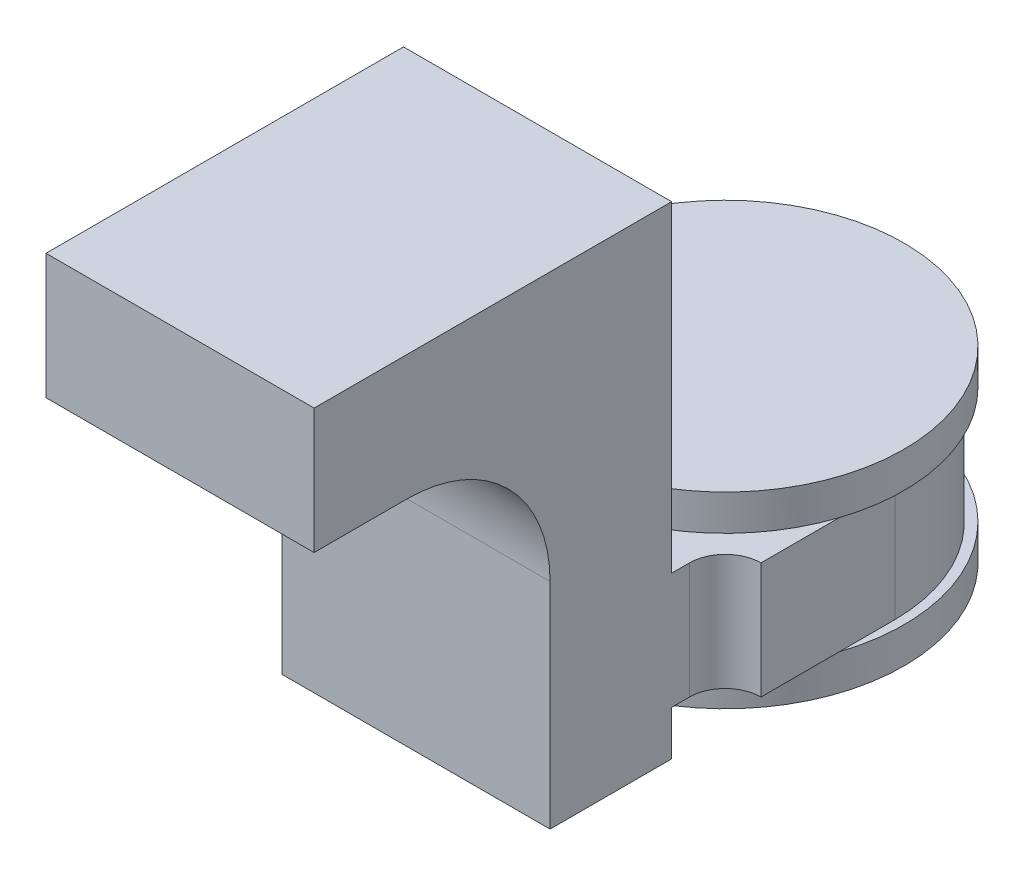
ISO-10303-21;
HEADER;
FILE_DESCRIPTION(('STEP AP214'),'2;1');
FILE_NAME('part.step','',(''),(''),'','','');
FILE_SCHEMA(('AUTOMOTIVE_DESIGN { 1 0 10303 214 1 1 1 1 }'));
ENDSEC;
DATA;
#1=APPLICATION_CONTEXT('core data for automotive mechanical design processes');
#2=APPLICATION_PROTOCOL_DEFINITION('international standard','automotive_design',2000,#1);
#3=PRODUCT_CONTEXT('',#1,'mechanical');
#4=PRODUCT('Part','Part','',(#3));
#5=PRODUCT_RELATED_PRODUCT_CATEGORY('part','',(#4));
#6=PRODUCT_DEFINITION_FORMATION('','',#4);
#7=PRODUCT_DEFINITION_CONTEXT('part definition',#1,'design');
#8=PRODUCT_DEFINITION('design','',#6,#7);
#9=PRODUCT_DEFINITION_SHAPE('','',#8);
#10=(LENGTH_UNIT() NAMED_UNIT(*) SI_UNIT(.MILLI.,.METRE.));
#11=(NAMED_UNIT(*) PLANE_ANGLE_UNIT() SI_UNIT($,.RADIAN.));
#12=(NAMED_UNIT(*) SI_UNIT($,.STERADIAN.) SOLID_ANGLE_UNIT());
#13=UNCERTAINTY_MEASURE_WITH_UNIT(LENGTH_MEASURE(1.E-05),#10,'distance_accuracy_value','');
#14=(GEOMETRIC_REPRESENTATION_CONTEXT(3) GLOBAL_UNCERTAINTY_ASSIGNED_CONTEXT((#13)) GLOBAL_UNIT_ASSIGNED_CONTEXT((#10,
#11,#12)) REPRESENTATION_CONTEXT('',''));
#15=CARTESIAN_POINT('',(0.,0.,0.));
#16=DIRECTION('',(0.,0.,1.));
#17=DIRECTION('',(1.,0.,0.));
#18=AXIS2_PLACEMENT_3D('',#15,#16,#17);
#19=CARTESIAN_POINT('',(7.5,0.,0.));
#20=DIRECTION('',(-1.,0.,0.));
#21=DIRECTION('',(0.,0.,1.));
#22=AXIS2_PLACEMENT_3D('',#19,#20,#21);
#23=PLANE('',#22);
#24=DIRECTION('',(0.,1.,0.));
#25=VECTOR('',#24,1.);
#26=CARTESIAN_POINT('',(7.5,24.5,30.5));
#27=LINE('',#26,#25);
#28=CARTESIAN_POINT('',(7.5,17.5,30.5));
#29=VERTEX_POINT('',#28);
#30=CARTESIAN_POINT('',(7.5,24.5,30.5));
#31=VERTEX_POINT('',#30);
#32=EDGE_CURVE('E155',#29,#31,#27,.T.);
#33=ORIENTED_EDGE('',*,*,#32,.F.);
#34=DIRECTION('',(0.,0.,-1.));
#35=VECTOR('',#34,1.);
#36=CARTESIAN_POINT('',(7.5,17.5,33.5));
#37=LINE('',#36,#35);
#38=CARTESIAN_POINT('',(7.5,17.5,25.3));
#39=VERTEX_POINT('',#38);
#40=EDGE_CURVE('E162',#29,#39,#37,.T.);
#41=ORIENTED_EDGE('',*,*,#40,.T.);
#42=CARTESIAN_POINT('',(7.5,9.5,25.3));
#43=DIRECTION('',(-1.,0.,0.));
#44=DIRECTION('',(0.,0.,1.));
#45=AXIS2_PLACEMENT_3D('',#42,#43,#44);
#46=CIRCLE('',#45,8.);
#47=CARTESIAN_POINT('',(7.5,9.5,17.3));
#48=VERTEX_POINT('',#47);
#49=EDGE_CURVE('E11',#39,#48,#46,.T.);
#50=ORIENTED_EDGE('',*,*,#49,.T.);
#51=DIRECTION('',(0.,1.,0.));
#52=VECTOR('',#51,1.);
#53=CARTESIAN_POINT('',(7.5,17.5,17.3));
#54=LINE('',#53,#52);
#55=CARTESIAN_POINT('',(7.5,-2.5,17.3));
#56=VERTEX_POINT('',#55);
#57=EDGE_CURVE('E281',#56,#48,#54,.T.);
#58=ORIENTED_EDGE('',*,*,#57,.F.);
#59=DIRECTION('',(0.,0.,-1.));
#60=VECTOR('',#59,1.);
#61=CARTESIAN_POINT('',(7.5,-2.5,20.3));
#62=LINE('',#61,#60);
#63=CARTESIAN_POINT('',(7.5,-2.5,10.5));
#64=VERTEX_POINT('',#63);
#65=EDGE_CURVE('E172',#56,#64,#62,.T.);
#66=ORIENTED_EDGE('',*,*,#65,.T.);
#67=DIRECTION('',(0.,-1.,0.));
#68=VECTOR('',#67,1.);
#69=CARTESIAN_POINT('',(7.5,0.,10.5));
#70=LINE('',#69,#68);
#71=CARTESIAN_POINT('',(7.5,0.,10.5));
#72=VERTEX_POINT('',#71);
#73=EDGE_CURVE('E292',#72,#64,#70,.T.);
#74=ORIENTED_EDGE('',*,*,#73,.F.);
#75=DIRECTION('',(0.,0.,-1.));
#76=VECTOR('',#75,1.);
#77=CARTESIAN_POINT('',(7.5,0.,7.5));
#78=LINE('',#77,#76);
#79=CARTESIAN_POINT('',(7.5,0.,9.5));
#80=VERTEX_POINT('',#79);
#81=EDGE_CURVE('E195',#72,#80,#78,.T.);
#82=ORIENTED_EDGE('',*,*,#81,.T.);
#83=DIRECTION('',(0.,1.,0.));
#84=VECTOR('',#83,1.);
#85=CARTESIAN_POINT('',(7.5,6.5,9.5));
#86=LINE('',#85,#84);
#87=CARTESIAN_POINT('',(7.5,6.5,9.5));
#88=VERTEX_POINT('',#87);
#89=EDGE_CURVE('E256',#80,#88,#86,.T.);
#90=ORIENTED_EDGE('',*,*,#89,.T.);
#91=DIRECTION('',(0.,0.,1.));
#92=VECTOR('',#91,1.);
#93=CARTESIAN_POINT('',(7.5,6.5,7.5));
#94=LINE('',#93,#92);
#95=CARTESIAN_POINT('',(7.5,6.5,10.5));
#96=VERTEX_POINT('',#95);
#97=EDGE_CURVE('E189',#88,#96,#94,.T.);
#98=ORIENTED_EDGE('',*,*,#97,.T.);
#99=DIRECTION('',(0.,-1.,0.));
#100=VECTOR('',#99,1.);
#101=CARTESIAN_POINT('',(7.5,24.5,10.5));
#102=LINE('',#101,#100);
#103=CARTESIAN_POINT('',(7.5,24.5,10.5));
#104=VERTEX_POINT('',#103);
#105=EDGE_CURVE('E302',#104,#96,#102,.T.);
#106=ORIENTED_EDGE('',*,*,#105,.F.);
#107=DIRECTION('',(0.,0.,-1.));
#108=VECTOR('',#107,1.);
#109=CARTESIAN_POINT('',(7.5,24.5,49.0271648444464));
#110=LINE('',#109,#108);
#111=EDGE_CURVE('E165',#31,#104,#110,.T.);
#112=ORIENTED_EDGE('',*,*,#111,.F.);
#113=EDGE_LOOP('',(#33,#41,#50,#58,#66,#74,#82,#90,#98,#106,#112));
#114=FACE_BOUND('',#113,.T.);
#115=ADVANCED_FACE('F34',(#114),#23,.F.);
#116=CARTESIAN_POINT('',(-7.5,0.,0.));
#117=DIRECTION('',(-1.,0.,0.));
#118=DIRECTION('',(0.,0.,1.));
#119=AXIS2_PLACEMENT_3D('',#116,#117,#118);
#120=PLANE('',#119);
#121=DIRECTION('',(0.,0.,-1.));
#122=VECTOR('',#121,1.);
#123=CARTESIAN_POINT('',(-7.5,17.5,33.5));
#124=LINE('',#123,#122);
#125=CARTESIAN_POINT('',(-7.5,17.5,30.5));
#126=VERTEX_POINT('',#125);
#127=CARTESIAN_POINT('',(-7.5,17.5,25.3));
#128=VERTEX_POINT('',#127);
#129=EDGE_CURVE('E169',#126,#128,#124,.T.);
#130=ORIENTED_EDGE('',*,*,#129,.F.);
#131=DIRECTION('',(0.,-1.,0.));
#132=VECTOR('',#131,1.);
#133=CARTESIAN_POINT('',(-7.5,24.5,30.5));
#134=LINE('',#133,#132);
#135=CARTESIAN_POINT('',(-7.5,24.5,30.5));
#136=VERTEX_POINT('',#135);
#137=EDGE_CURVE('E158',#136,#126,#134,.T.);
#138=ORIENTED_EDGE('',*,*,#137,.F.);
#139=DIRECTION('',(0.,0.,-1.));
#140=VECTOR('',#139,1.);
#141=CARTESIAN_POINT('',(-7.5,24.5,49.0271648444464));
#142=LINE('',#141,#140);
#143=CARTESIAN_POINT('',(-7.5,24.5,10.5));
#144=VERTEX_POINT('',#143);
#145=EDGE_CURVE('E198',#136,#144,#142,.T.);
#146=ORIENTED_EDGE('',*,*,#145,.T.);
#147=DIRECTION('',(0.,1.,0.));
#148=VECTOR('',#147,1.);
#149=CARTESIAN_POINT('',(-7.5,24.5,10.5));
#150=LINE('',#149,#148);
#151=CARTESIAN_POINT('',(-7.5,6.5,10.5));
#152=VERTEX_POINT('',#151);
#153=EDGE_CURVE('E175',#152,#144,#150,.T.);
#154=ORIENTED_EDGE('',*,*,#153,.F.);
#155=DIRECTION('',(0.,0.,-1.));
#156=VECTOR('',#155,1.);
#157=CARTESIAN_POINT('',(-7.5,6.5,7.5));
#158=LINE('',#157,#156);
#159=CARTESIAN_POINT('',(-7.5,6.5,9.5));
#160=VERTEX_POINT('',#159);
#161=EDGE_CURVE('E188',#152,#160,#158,.T.);
#162=ORIENTED_EDGE('',*,*,#161,.T.);
#163=DIRECTION('',(0.,-1.,0.));
#164=VECTOR('',#163,1.);
#165=CARTESIAN_POINT('',(-7.5,0.,9.5));
#166=LINE('',#165,#164);
#167=CARTESIAN_POINT('',(-7.5,0.,9.5));
#168=VERTEX_POINT('',#167);
#169=EDGE_CURVE('E259',#160,#168,#166,.T.);
#170=ORIENTED_EDGE('',*,*,#169,.T.);
#171=DIRECTION('',(0.,0.,1.));
#172=VECTOR('',#171,1.);
#173=CARTESIAN_POINT('',(-7.5,0.,7.5));
#174=LINE('',#173,#172);
#175=CARTESIAN_POINT('',(-7.5,0.,10.5));
#176=VERTEX_POINT('',#175);
#177=EDGE_CURVE('E190',#168,#176,#174,.T.);
#178=ORIENTED_EDGE('',*,*,#177,.T.);
#179=DIRECTION('',(0.,1.,0.));
#180=VECTOR('',#179,1.);
#181=CARTESIAN_POINT('',(-7.5,0.,10.5));
#182=LINE('',#181,#180);
#183=CARTESIAN_POINT('',(-7.5,-2.5,10.5));
#184=VERTEX_POINT('',#183);
#185=EDGE_CURVE('E298',#184,#176,#182,.T.);
#186=ORIENTED_EDGE('',*,*,#185,.F.);
#187=DIRECTION('',(0.,0.,-1.));
#188=VECTOR('',#187,1.);
#189=CARTESIAN_POINT('',(-7.5,-2.5,20.3));
#190=LINE('',#189,#188);
#191=CARTESIAN_POINT('',(-7.5,-2.5,17.3));
#192=VERTEX_POINT('',#191);
#193=EDGE_CURVE('E285',#192,#184,#190,.T.);
#194=ORIENTED_EDGE('',*,*,#193,.F.);
#195=DIRECTION('',(0.,-1.,0.));
#196=VECTOR('',#195,1.);
#197=CARTESIAN_POINT('',(-7.5,17.5,17.3));
#198=LINE('',#197,#196);
#199=CARTESIAN_POINT('',(-7.5,9.5,17.3));
#200=VERTEX_POINT('',#199);
#201=EDGE_CURVE('E278',#200,#192,#198,.T.);
#202=ORIENTED_EDGE('',*,*,#201,.F.);
#203=CARTESIAN_POINT('',(-7.5,9.5,25.3));
#204=DIRECTION('',(-1.,0.,0.));
#205=DIRECTION('',(0.,0.,1.));
#206=AXIS2_PLACEMENT_3D('',#203,#204,#205);
#207=CIRCLE('',#206,8.);
#208=EDGE_CURVE('E42',#200,#128,#207,.F.);
#209=ORIENTED_EDGE('',*,*,#208,.T.);
#210=EDGE_LOOP('',(#130,#138,#146,#154,#162,#170,#178,#186,#194,#202,#209));
#211=FACE_BOUND('',#210,.T.);
#212=ADVANCED_FACE('F284',(#211),#120,.T.);
#213=CARTESIAN_POINT('',(0.,24.5,49.0271648444464));
#214=DIRECTION('',(0.,1.,0.));
#215=DIRECTION('',(0.,0.,1.));
#216=AXIS2_PLACEMENT_3D('',#213,#214,#215);
#217=PLANE('',#216);
#218=ORIENTED_EDGE('',*,*,#145,.F.);
#219=DIRECTION('',(-1.,0.,0.));
#220=VECTOR('',#219,1.);
#221=CARTESIAN_POINT('',(-7.5,24.5,30.5));
#222=LINE('',#221,#220);
#223=EDGE_CURVE('E166',#31,#136,#222,.T.);
#224=ORIENTED_EDGE('',*,*,#223,.F.);
#225=ORIENTED_EDGE('',*,*,#111,.T.);
#226=DIRECTION('',(1.,0.,0.));
#227=VECTOR('',#226,1.);
#228=CARTESIAN_POINT('',(7.5,24.5,10.5));
#229=LINE('',#228,#227);
#230=EDGE_CURVE('E170',#144,#104,#229,.T.);
#231=ORIENTED_EDGE('',*,*,#230,.F.);
#232=EDGE_LOOP('',(#218,#224,#225,#231));
#233=FACE_BOUND('',#232,.T.);
#234=ADVANCED_FACE('F314',(#233),#217,.T.);
#235=CARTESIAN_POINT('',(-7.5,17.5,33.5));
#236=DIRECTION('',(0.,1.,0.));
#237=DIRECTION('',(0.,0.,1.));
#238=AXIS2_PLACEMENT_3D('',#235,#236,#237);
#239=PLANE('',#238);
#240=ORIENTED_EDGE('',*,*,#129,.T.);
#241=DIRECTION('',(-1.,0.,0.));
#242=VECTOR('',#241,1.);
#243=CARTESIAN_POINT('',(-7.5,17.5,25.3));
#244=LINE('',#243,#242);
#245=EDGE_CURVE('E49',#128,#39,#244,.F.);
#246=ORIENTED_EDGE('',*,*,#245,.T.);
#247=ORIENTED_EDGE('',*,*,#40,.F.);
#248=DIRECTION('',(1.,0.,0.));
#249=VECTOR('',#248,1.);
#250=CARTESIAN_POINT('',(-7.5,17.5,30.5));
#251=LINE('',#250,#249);
#252=EDGE_CURVE('E152',#126,#29,#251,.T.);
#253=ORIENTED_EDGE('',*,*,#252,.F.);
#254=EDGE_LOOP('',(#240,#246,#247,#253));
#255=FACE_BOUND('',#254,.T.);
#256=ADVANCED_FACE('F168',(#255),#239,.F.);
#257=CARTESIAN_POINT('',(-7.5,-2.5,20.3));
#258=DIRECTION('',(0.,1.,0.));
#259=DIRECTION('',(0.,0.,1.));
#260=AXIS2_PLACEMENT_3D('',#257,#258,#259);
#261=PLANE('',#260);
#262=DIRECTION('',(1.,0.,0.));
#263=VECTOR('',#262,1.);
#264=CARTESIAN_POINT('',(-7.5,-2.5,17.3));
#265=LINE('',#264,#263);
#266=EDGE_CURVE('E286',#192,#56,#265,.T.);
#267=ORIENTED_EDGE('',*,*,#266,.F.);
#268=ORIENTED_EDGE('',*,*,#193,.T.);
#269=DIRECTION('',(-1.,0.,0.));
#270=VECTOR('',#269,1.);
#271=CARTESIAN_POINT('',(7.5,-2.5,10.5));
#272=LINE('',#271,#270);
#273=EDGE_CURVE('E295',#64,#184,#272,.T.);
#274=ORIENTED_EDGE('',*,*,#273,.F.);
#275=ORIENTED_EDGE('',*,*,#65,.F.);
#276=EDGE_LOOP('',(#267,#268,#274,#275));
#277=FACE_BOUND('',#276,.T.);
#278=ADVANCED_FACE('F326',(#277),#261,.F.);
#279=CARTESIAN_POINT('',(0.,0.,0.0612691628307606));
#280=DIRECTION('',(0.,-1.,0.));
#281=DIRECTION('',(0.,0.,-1.));
#282=AXIS2_PLACEMENT_3D('',#279,#280,#281);
#283=PLANE('',#282);
#284=DIRECTION('',(1.,0.,0.));
#285=VECTOR('',#284,1.);
#286=CARTESIAN_POINT('',(7.5,0.,10.5));
#287=LINE('',#286,#285);
#288=EDGE_CURVE('E300',#176,#72,#287,.T.);
#289=ORIENTED_EDGE('',*,*,#288,.F.);
#290=ORIENTED_EDGE('',*,*,#177,.F.);
#291=CARTESIAN_POINT('',(-9.5,0.,9.5));
#292=DIRECTION('',(0.,-1.,0.));
#293=DIRECTION('',(0.,0.,-1.));
#294=AXIS2_PLACEMENT_3D('',#291,#292,#293);
#295=CIRCLE('',#294,2.);
#296=CARTESIAN_POINT('',(-9.5,0.,7.5));
#297=VERTEX_POINT('',#296);
#298=EDGE_CURVE('E266',#168,#297,#295,.F.);
#299=ORIENTED_EDGE('',*,*,#298,.T.);
#300=DIRECTION('',(0.,0.,1.));
#301=VECTOR('',#300,1.);
#302=CARTESIAN_POINT('',(-9.5,0.,0.));
#303=LINE('',#302,#301);
#304=CARTESIAN_POINT('',(-9.5,0.,3.1224989991992));
#305=VERTEX_POINT('',#304);
#306=EDGE_CURVE('E241',#305,#297,#303,.T.);
#307=ORIENTED_EDGE('',*,*,#306,.F.);
#308=CARTESIAN_POINT('',(0.,0.,0.));
#309=DIRECTION('',(0.,-1.,0.));
#310=DIRECTION('',(0.,0.,-1.));
#311=AXIS2_PLACEMENT_3D('',#308,#309,#310);
#312=CIRCLE('',#311,10.);
#313=CARTESIAN_POINT('',(9.5,0.,3.1224989991992));
#314=VERTEX_POINT('',#313);
#315=EDGE_CURVE('E217',#314,#305,#312,.T.);
#316=ORIENTED_EDGE('',*,*,#315,.F.);
#317=DIRECTION('',(0.,0.,-1.));
#318=VECTOR('',#317,1.);
#319=CARTESIAN_POINT('',(9.5,0.,0.));
#320=LINE('',#319,#318);
#321=CARTESIAN_POINT('',(9.5,0.,7.5));
#322=VERTEX_POINT('',#321);
#323=EDGE_CURVE('E231',#322,#314,#320,.T.);
#324=ORIENTED_EDGE('',*,*,#323,.F.);
#325=CARTESIAN_POINT('',(9.5,0.,9.5));
#326=DIRECTION('',(0.,-1.,0.));
#327=DIRECTION('',(0.,0.,-1.));
#328=AXIS2_PLACEMENT_3D('',#325,#326,#327);
#329=CIRCLE('',#328,2.);
#330=EDGE_CURVE('E263',#322,#80,#329,.F.);
#331=ORIENTED_EDGE('',*,*,#330,.T.);
#332=ORIENTED_EDGE('',*,*,#81,.F.);
#333=EDGE_LOOP('',(#289,#290,#299,#307,#316,#324,#331,#332));
#334=FACE_BOUND('',#333,.T.);
#335=ADVANCED_FACE('F332',(#334),#283,.T.);
#336=CARTESIAN_POINT('',(0.,6.5,0.0612691628307606));
#337=DIRECTION('',(0.,-1.,0.));
#338=DIRECTION('',(0.,0.,-1.));
#339=AXIS2_PLACEMENT_3D('',#336,#337,#338);
#340=CYLINDRICAL_SURFACE('',#339,9.50019757217259);
#341=CARTESIAN_POINT('',(0.,0.,0.0612691628307606));
#342=DIRECTION('',(0.,1.,0.));
#343=DIRECTION('',(0.,0.,-1.));
#344=AXIS2_PLACEMENT_3D('',#341,#342,#343);
#345=CIRCLE('',#344,9.50019757217259);
#346=CARTESIAN_POINT('',(9.5,0.,0.));
#347=VERTEX_POINT('',#346);
#348=CARTESIAN_POINT('',(-9.5,0.,0.));
#349=VERTEX_POINT('',#348);
#350=EDGE_CURVE('E223',#347,#349,#345,.T.);
#351=ORIENTED_EDGE('',*,*,#350,.T.);
#352=DIRECTION('',(0.,-1.,0.));
#353=VECTOR('',#352,1.);
#354=CARTESIAN_POINT('',(-9.5,6.5,0.));
#355=LINE('',#354,#353);
#356=CARTESIAN_POINT('',(-9.5,6.5,0.));
#357=VERTEX_POINT('',#356);
#358=EDGE_CURVE('E254',#357,#349,#355,.T.);
#359=ORIENTED_EDGE('',*,*,#358,.F.);
#360=CARTESIAN_POINT('',(0.,6.5,0.0612691628307606));
#361=DIRECTION('',(0.,1.,0.));
#362=DIRECTION('',(0.,0.,-1.));
#363=AXIS2_PLACEMENT_3D('',#360,#361,#362);
#364=CIRCLE('',#363,9.50019757217259);
#365=CARTESIAN_POINT('',(9.5,6.5,0.));
#366=VERTEX_POINT('',#365);
#367=EDGE_CURVE('E227',#366,#357,#364,.T.);
#368=ORIENTED_EDGE('',*,*,#367,.F.);
#369=DIRECTION('',(0.,-1.,0.));
#370=VECTOR('',#369,1.);
#371=CARTESIAN_POINT('',(9.5,6.5,0.));
#372=LINE('',#371,#370);
#373=EDGE_CURVE('E238',#366,#347,#372,.T.);
#374=ORIENTED_EDGE('',*,*,#373,.T.);
#375=EDGE_LOOP('',(#351,#359,#368,#374));
#376=FACE_BOUND('',#375,.T.);
#377=ADVANCED_FACE('F406',(#376),#340,.T.);
#378=CARTESIAN_POINT('',(-9.5,6.5,0.));
#379=DIRECTION('',(1.,0.,0.));
#380=DIRECTION('',(0.,0.,-1.));
#381=AXIS2_PLACEMENT_3D('',#378,#379,#380);
#382=PLANE('',#381);
#383=EDGE_CURVE('E242',#349,#305,#303,.T.);
#384=ORIENTED_EDGE('',*,*,#383,.T.);
#385=ORIENTED_EDGE('',*,*,#306,.T.);
#386=DIRECTION('',(0.,-1.,0.));
#387=VECTOR('',#386,1.);
#388=CARTESIAN_POINT('',(-9.5,6.5,7.5));
#389=LINE('',#388,#387);
#390=CARTESIAN_POINT('',(-9.5,6.5,7.5));
#391=VERTEX_POINT('',#390);
#392=EDGE_CURVE('E251',#391,#297,#389,.T.);
#393=ORIENTED_EDGE('',*,*,#392,.F.);
#394=DIRECTION('',(0.,0.,1.));
#395=VECTOR('',#394,1.);
#396=CARTESIAN_POINT('',(-9.5,6.5,0.));
#397=LINE('',#396,#395);
#398=CARTESIAN_POINT('',(-9.5,6.5,3.1224989991992));
#399=VERTEX_POINT('',#398);
#400=EDGE_CURVE('E230',#399,#391,#397,.T.);
#401=ORIENTED_EDGE('',*,*,#400,.F.);
#402=EDGE_CURVE('E232',#357,#399,#397,.T.);
#403=ORIENTED_EDGE('',*,*,#402,.F.);
#404=ORIENTED_EDGE('',*,*,#358,.T.);
#405=EDGE_LOOP('',(#384,#385,#393,#401,#403,#404));
#406=FACE_BOUND('',#405,.T.);
#407=ADVANCED_FACE('F349',(#406),#382,.F.);
#408=CARTESIAN_POINT('',(9.5,6.5,0.));
#409=DIRECTION('',(-1.,0.,0.));
#410=DIRECTION('',(0.,0.,1.));
#411=AXIS2_PLACEMENT_3D('',#408,#409,#410);
#412=PLANE('',#411);
#413=ORIENTED_EDGE('',*,*,#323,.T.);
#414=EDGE_CURVE('E244',#314,#347,#320,.T.);
#415=ORIENTED_EDGE('',*,*,#414,.T.);
#416=ORIENTED_EDGE('',*,*,#373,.F.);
#417=DIRECTION('',(0.,0.,-1.));
#418=VECTOR('',#417,1.);
#419=CARTESIAN_POINT('',(9.5,6.5,0.));
#420=LINE('',#419,#418);
#421=CARTESIAN_POINT('',(9.5,6.5,3.1224989991992));
#422=VERTEX_POINT('',#421);
#423=EDGE_CURVE('E235',#422,#366,#420,.T.);
#424=ORIENTED_EDGE('',*,*,#423,.F.);
#425=CARTESIAN_POINT('',(9.5,6.5,7.5));
#426=VERTEX_POINT('',#425);
#427=EDGE_CURVE('E236',#426,#422,#420,.T.);
#428=ORIENTED_EDGE('',*,*,#427,.F.);
#429=DIRECTION('',(0.,-1.,0.));
#430=VECTOR('',#429,1.);
#431=CARTESIAN_POINT('',(9.5,6.5,7.5));
#432=LINE('',#431,#430);
#433=EDGE_CURVE('E249',#426,#322,#432,.T.);
#434=ORIENTED_EDGE('',*,*,#433,.T.);
#435=EDGE_LOOP('',(#413,#415,#416,#424,#428,#434));
#436=FACE_BOUND('',#435,.T.);
#437=ADVANCED_FACE('F339',(#436),#412,.F.);
#438=CARTESIAN_POINT('',(0.,6.5,0.0612691628307606));
#439=DIRECTION('',(0.,-1.,0.));
#440=DIRECTION('',(0.,0.,-1.));
#441=AXIS2_PLACEMENT_3D('',#438,#439,#440);
#442=PLANE('',#441);
#443=ORIENTED_EDGE('',*,*,#161,.F.);
#444=DIRECTION('',(-1.,0.,0.));
#445=VECTOR('',#444,1.);
#446=CARTESIAN_POINT('',(7.5,6.5,10.5));
#447=LINE('',#446,#445);
#448=EDGE_CURVE('E305',#96,#152,#447,.T.);
#449=ORIENTED_EDGE('',*,*,#448,.F.);
#450=ORIENTED_EDGE('',*,*,#97,.F.);
#451=CARTESIAN_POINT('',(9.5,6.5,9.5));
#452=DIRECTION('',(0.,-1.,0.));
#453=DIRECTION('',(0.,0.,-1.));
#454=AXIS2_PLACEMENT_3D('',#451,#452,#453);
#455=CIRCLE('',#454,2.);
#456=EDGE_CURVE('E261',#88,#426,#455,.T.);
#457=ORIENTED_EDGE('',*,*,#456,.T.);
#458=ORIENTED_EDGE('',*,*,#427,.T.);
#459=CARTESIAN_POINT('',(0.,6.5,0.));
#460=DIRECTION('',(0.,1.,0.));
#461=DIRECTION('',(0.,0.,1.));
#462=AXIS2_PLACEMENT_3D('',#459,#460,#461);
#463=CIRCLE('',#462,10.);
#464=EDGE_CURVE('E226',#399,#422,#463,.T.);
#465=ORIENTED_EDGE('',*,*,#464,.F.);
#466=ORIENTED_EDGE('',*,*,#400,.T.);
#467=CARTESIAN_POINT('',(-9.5,6.5,9.5));
#468=DIRECTION('',(0.,-1.,0.));
#469=DIRECTION('',(0.,0.,-1.));
#470=AXIS2_PLACEMENT_3D('',#467,#468,#469);
#471=CIRCLE('',#470,2.);
#472=EDGE_CURVE('E268',#391,#160,#471,.T.);
#473=ORIENTED_EDGE('',*,*,#472,.T.);
#474=EDGE_LOOP('',(#443,#449,#450,#457,#458,#465,#466,#473));
#475=FACE_BOUND('',#474,.T.);
#476=ADVANCED_FACE('F319',(#475),#442,.F.);
#477=CARTESIAN_POINT('',(0.,6.5,0.));
#478=DIRECTION('',(0.,1.,0.));
#479=DIRECTION('',(0.,0.,1.));
#480=AXIS2_PLACEMENT_3D('',#477,#478,#479);
#481=PLANE('',#480);
#482=ORIENTED_EDGE('',*,*,#367,.T.);
#483=ORIENTED_EDGE('',*,*,#402,.T.);
#484=EDGE_CURVE('E216',#422,#399,#463,.T.);
#485=ORIENTED_EDGE('',*,*,#484,.F.);
#486=ORIENTED_EDGE('',*,*,#423,.T.);
#487=EDGE_LOOP('',(#482,#483,#485,#486));
#488=FACE_BOUND('',#487,.T.);
#489=ADVANCED_FACE('F353',(#488),#481,.F.);
#490=CARTESIAN_POINT('',(0.,8.5,0.));
#491=DIRECTION('',(0.,-1.,0.));
#492=DIRECTION('',(0.,0.,-1.));
#493=AXIS2_PLACEMENT_3D('',#490,#491,#492);
#494=CYLINDRICAL_SURFACE('',#493,10.);
#495=CARTESIAN_POINT('',(0.,8.5,0.));
#496=DIRECTION('',(0.,1.,0.));
#497=DIRECTION('',(0.,0.,1.));
#498=AXIS2_PLACEMENT_3D('',#495,#496,#497);
#499=CIRCLE('',#498,10.);
#500=CARTESIAN_POINT('',(0.,8.5,10.));
#501=VERTEX_POINT('',#500);
#502=EDGE_CURVE('E220',#501,#501,#499,.T.);
#503=ORIENTED_EDGE('',*,*,#502,.F.);
#504=EDGE_LOOP('',(#503));
#505=FACE_BOUND('',#504,.T.);
#506=ORIENTED_EDGE('',*,*,#484,.T.);
#507=ORIENTED_EDGE('',*,*,#464,.T.);
#508=EDGE_LOOP('',(#506,#507));
#509=FACE_BOUND('',#508,.T.);
#510=ADVANCED_FACE('F355',(#505,#509),#494,.T.);
#511=CARTESIAN_POINT('',(0.,8.5,0.));
#512=DIRECTION('',(0.,1.,0.));
#513=DIRECTION('',(0.,0.,1.));
#514=AXIS2_PLACEMENT_3D('',#511,#512,#513);
#515=PLANE('',#514);
#516=ORIENTED_EDGE('',*,*,#502,.T.);
#517=EDGE_LOOP('',(#516));
#518=FACE_BOUND('',#517,.T.);
#519=ADVANCED_FACE('F357',(#518),#515,.T.);
#520=CARTESIAN_POINT('',(0.,-2.,0.));
#521=DIRECTION('',(0.,1.,0.));
#522=DIRECTION('',(0.,0.,1.));
#523=AXIS2_PLACEMENT_3D('',#520,#521,#522);
#524=CYLINDRICAL_SURFACE('',#523,10.);
#525=CARTESIAN_POINT('',(0.,-2.,0.));
#526=DIRECTION('',(0.,-1.,0.));
#527=DIRECTION('',(0.,0.,-1.));
#528=AXIS2_PLACEMENT_3D('',#525,#526,#527);
#529=CIRCLE('',#528,10.);
#530=CARTESIAN_POINT('',(0.,-2.,-10.));
#531=VERTEX_POINT('',#530);
#532=EDGE_CURVE('E213',#531,#531,#529,.T.);
#533=ORIENTED_EDGE('',*,*,#532,.F.);
#534=EDGE_LOOP('',(#533));
#535=FACE_BOUND('',#534,.T.);
#536=ORIENTED_EDGE('',*,*,#315,.T.);
#537=EDGE_CURVE('E210',#305,#314,#312,.T.);
#538=ORIENTED_EDGE('',*,*,#537,.T.);
#539=EDGE_LOOP('',(#536,#538));
#540=FACE_BOUND('',#539,.T.);
#541=ADVANCED_FACE('F364',(#535,#540),#524,.T.);
#542=CARTESIAN_POINT('',(0.,-2.,0.));
#543=DIRECTION('',(0.,-1.,0.));
#544=DIRECTION('',(0.,0.,-1.));
#545=AXIS2_PLACEMENT_3D('',#542,#543,#544);
#546=PLANE('',#545);
#547=CARTESIAN_POINT('',(0.,-2.,0.));
#548=DIRECTION('',(0.,-1.,0.));
#549=DIRECTION('',(0.,0.,-1.));
#550=AXIS2_PLACEMENT_3D('',#547,#548,#549);
#551=CIRCLE('',#550,5.);
#552=CARTESIAN_POINT('',(0.,-2.,-5.));
#553=VERTEX_POINT('',#552);
#554=EDGE_CURVE('E206',#553,#553,#551,.T.);
#555=ORIENTED_EDGE('',*,*,#554,.F.);
#556=EDGE_LOOP('',(#555));
#557=FACE_BOUND('',#556,.T.);
#558=ORIENTED_EDGE('',*,*,#532,.T.);
#559=EDGE_LOOP('',(#558));
#560=FACE_BOUND('',#559,.T.);
#561=ADVANCED_FACE('F387',(#557,#560),#546,.T.);
#562=CARTESIAN_POINT('',(0.,0.,0.));
#563=DIRECTION('',(0.,-1.,0.));
#564=DIRECTION('',(0.,0.,-1.));
#565=AXIS2_PLACEMENT_3D('',#562,#563,#564);
#566=PLANE('',#565);
#567=ORIENTED_EDGE('',*,*,#414,.F.);
#568=ORIENTED_EDGE('',*,*,#537,.F.);
#569=ORIENTED_EDGE('',*,*,#383,.F.);
#570=ORIENTED_EDGE('',*,*,#350,.F.);
#571=EDGE_LOOP('',(#567,#568,#569,#570));
#572=FACE_BOUND('',#571,.T.);
#573=ADVANCED_FACE('F385',(#572),#566,.F.);
#574=CARTESIAN_POINT('',(0.,-3.5,0.));
#575=DIRECTION('',(0.,1.,0.));
#576=DIRECTION('',(0.,0.,1.));
#577=AXIS2_PLACEMENT_3D('',#574,#575,#576);
#578=CYLINDRICAL_SURFACE('',#577,5.);
#579=CARTESIAN_POINT('',(0.,-3.5,0.));
#580=DIRECTION('',(0.,-1.,0.));
#581=DIRECTION('',(0.,0.,-1.));
#582=AXIS2_PLACEMENT_3D('',#579,#580,#581);
#583=CIRCLE('',#582,5.);
#584=CARTESIAN_POINT('',(0.,-3.5,-5.));
#585=VERTEX_POINT('',#584);
#586=EDGE_CURVE('E207',#585,#585,#583,.T.);
#587=ORIENTED_EDGE('',*,*,#586,.F.);
#588=EDGE_LOOP('',(#587));
#589=FACE_BOUND('',#588,.T.);
#590=ORIENTED_EDGE('',*,*,#554,.T.);
#591=EDGE_LOOP('',(#590));
#592=FACE_BOUND('',#591,.T.);
#593=ADVANCED_FACE('F381',(#589,#592),#578,.T.);
#594=CARTESIAN_POINT('',(0.,-3.5,0.));
#595=DIRECTION('',(0.,-1.,0.));
#596=DIRECTION('',(0.,0.,-1.));
#597=AXIS2_PLACEMENT_3D('',#594,#595,#596);
#598=PLANE('',#597);
#599=ORIENTED_EDGE('',*,*,#586,.T.);
#600=EDGE_LOOP('',(#599));
#601=FACE_BOUND('',#600,.T.);
#602=ADVANCED_FACE('F378',(#601),#598,.T.);
#603=CARTESIAN_POINT('',(9.5,0.,9.5));
#604=DIRECTION('',(0.,-1.,0.));
#605=DIRECTION('',(0.,0.,-1.));
#606=AXIS2_PLACEMENT_3D('',#603,#604,#605);
#607=CYLINDRICAL_SURFACE('',#606,2.);
#608=ORIENTED_EDGE('',*,*,#330,.F.);
#609=ORIENTED_EDGE('',*,*,#433,.F.);
#610=ORIENTED_EDGE('',*,*,#456,.F.);
#611=ORIENTED_EDGE('',*,*,#89,.F.);
#612=EDGE_LOOP('',(#608,#609,#610,#611));
#613=FACE_BOUND('',#612,.T.);
#614=ADVANCED_FACE('F337',(#613),#607,.F.);
#615=CARTESIAN_POINT('',(-9.5,0.,9.5));
#616=DIRECTION('',(0.,-1.,0.));
#617=DIRECTION('',(0.,0.,-1.));
#618=AXIS2_PLACEMENT_3D('',#615,#616,#617);
#619=CYLINDRICAL_SURFACE('',#618,2.);
#620=ORIENTED_EDGE('',*,*,#472,.F.);
#621=ORIENTED_EDGE('',*,*,#392,.T.);
#622=ORIENTED_EDGE('',*,*,#298,.F.);
#623=ORIENTED_EDGE('',*,*,#169,.F.);
#624=EDGE_LOOP('',(#620,#621,#622,#623));
#625=FACE_BOUND('',#624,.T.);
#626=ADVANCED_FACE('F418',(#625),#619,.F.);
#627=CARTESIAN_POINT('',(0.,0.,10.5));
#628=DIRECTION('',(0.,0.,-1.));
#629=DIRECTION('',(-1.,0.,0.));
#630=AXIS2_PLACEMENT_3D('',#627,#628,#629);
#631=PLANE('',#630);
#632=ORIENTED_EDGE('',*,*,#105,.T.);
#633=ORIENTED_EDGE('',*,*,#448,.T.);
#634=ORIENTED_EDGE('',*,*,#153,.T.);
#635=ORIENTED_EDGE('',*,*,#230,.T.);
#636=EDGE_LOOP('',(#632,#633,#634,#635));
#637=FACE_BOUND('',#636,.T.);
#638=ADVANCED_FACE('F316',(#637),#631,.T.);
#639=CARTESIAN_POINT('',(0.,0.,10.5));
#640=DIRECTION('',(0.,0.,-1.));
#641=DIRECTION('',(-1.,0.,0.));
#642=AXIS2_PLACEMENT_3D('',#639,#640,#641);
#643=PLANE('',#642);
#644=ORIENTED_EDGE('',*,*,#73,.T.);
#645=ORIENTED_EDGE('',*,*,#273,.T.);
#646=ORIENTED_EDGE('',*,*,#185,.T.);
#647=ORIENTED_EDGE('',*,*,#288,.T.);
#648=EDGE_LOOP('',(#644,#645,#646,#647));
#649=FACE_BOUND('',#648,.T.);
#650=ADVANCED_FACE('F328',(#649),#643,.T.);
#651=CARTESIAN_POINT('',(0.,0.,17.3));
#652=DIRECTION('',(0.,0.,1.));
#653=DIRECTION('',(1.,0.,0.));
#654=AXIS2_PLACEMENT_3D('',#651,#652,#653);
#655=PLANE('',#654);
#656=ORIENTED_EDGE('',*,*,#57,.T.);
#657=DIRECTION('',(-1.,0.,0.));
#658=VECTOR('',#657,1.);
#659=CARTESIAN_POINT('',(0.,9.5,17.3));
#660=LINE('',#659,#658);
#661=EDGE_CURVE('E181',#48,#200,#660,.T.);
#662=ORIENTED_EDGE('',*,*,#661,.T.);
#663=ORIENTED_EDGE('',*,*,#201,.T.);
#664=ORIENTED_EDGE('',*,*,#266,.T.);
#665=EDGE_LOOP('',(#656,#662,#663,#664));
#666=FACE_BOUND('',#665,.T.);
#667=ADVANCED_FACE('F277',(#666),#655,.T.);
#668=CARTESIAN_POINT('',(0.,0.,30.5));
#669=DIRECTION('',(0.,0.,1.));
#670=DIRECTION('',(1.,0.,0.));
#671=AXIS2_PLACEMENT_3D('',#668,#669,#670);
#672=PLANE('',#671);
#673=ORIENTED_EDGE('',*,*,#137,.T.);
#674=ORIENTED_EDGE('',*,*,#252,.T.);
#675=ORIENTED_EDGE('',*,*,#32,.T.);
#676=ORIENTED_EDGE('',*,*,#223,.T.);
#677=EDGE_LOOP('',(#673,#674,#675,#676));
#678=FACE_BOUND('',#677,.T.);
#679=ADVANCED_FACE('F154',(#678),#672,.T.);
#680=CARTESIAN_POINT('',(0.,9.5,25.3));
#681=DIRECTION('',(-1.,0.,0.));
#682=DIRECTION('',(0.,0.,1.));
#683=AXIS2_PLACEMENT_3D('',#680,#681,#682);
#684=CYLINDRICAL_SURFACE('',#683,8.);
#685=ORIENTED_EDGE('',*,*,#49,.F.);
#686=ORIENTED_EDGE('',*,*,#245,.F.);
#687=ORIENTED_EDGE('',*,*,#208,.F.);
#688=ORIENTED_EDGE('',*,*,#661,.F.);
#689=EDGE_LOOP('',(#685,#686,#687,#688));
#690=FACE_BOUND('',#689,.T.);
#691=ADVANCED_FACE('F36',(#690),#684,.F.);
#692=CLOSED_SHELL('',(#115,#212,#234,#256,#278,#335,#377,#407,#437,#476,#489,#510,#519,#541,
#561,#573,#593,#602,#614,#626,#638,#650,#667,#679,#691));
#693=MANIFOLD_SOLID_BREP('B2',#692);
#694=ADVANCED_BREP_SHAPE_REPRESENTATION('',(#18,#693),#14);
#695=SHAPE_DEFINITION_REPRESENTATION(#9,#694);
ENDSEC;
END-ISO-10303-21;
